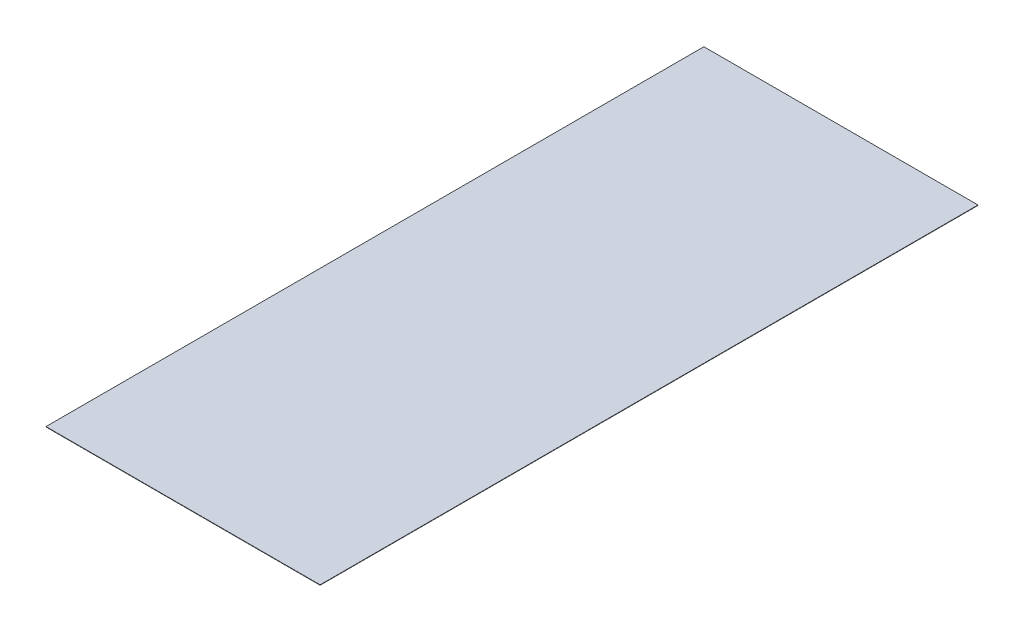
ISO-10303-21;
HEADER;
FILE_DESCRIPTION(('STEP AP214'),'2;1');
FILE_NAME('part.step','',(''),(''),'','','');
FILE_SCHEMA(('AUTOMOTIVE_DESIGN { 1 0 10303 214 1 1 1 1 }'));
ENDSEC;
DATA;
#1=APPLICATION_CONTEXT('core data for automotive mechanical design processes');
#2=APPLICATION_PROTOCOL_DEFINITION('international standard','automotive_design',2000,#1);
#3=PRODUCT_CONTEXT('',#1,'mechanical');
#4=PRODUCT('Part','Part','',(#3));
#5=PRODUCT_RELATED_PRODUCT_CATEGORY('part','',(#4));
#6=PRODUCT_DEFINITION_FORMATION('','',#4);
#7=PRODUCT_DEFINITION_CONTEXT('part definition',#1,'design');
#8=PRODUCT_DEFINITION('design','',#6,#7);
#9=PRODUCT_DEFINITION_SHAPE('','',#8);
#10=(LENGTH_UNIT() NAMED_UNIT(*) SI_UNIT(.MILLI.,.METRE.));
#11=(NAMED_UNIT(*) PLANE_ANGLE_UNIT() SI_UNIT($,.RADIAN.));
#12=(NAMED_UNIT(*) SI_UNIT($,.STERADIAN.) SOLID_ANGLE_UNIT());
#13=UNCERTAINTY_MEASURE_WITH_UNIT(LENGTH_MEASURE(1.E-05),#10,'distance_accuracy_value','');
#14=(GEOMETRIC_REPRESENTATION_CONTEXT(3) GLOBAL_UNCERTAINTY_ASSIGNED_CONTEXT((#13)) GLOBAL_UNIT_ASSIGNED_CONTEXT((#10,
#11,#12)) REPRESENTATION_CONTEXT('',''));
#15=CARTESIAN_POINT('',(0.,0.,0.));
#16=DIRECTION('',(0.,0.,1.));
#17=DIRECTION('',(1.,0.,0.));
#18=AXIS2_PLACEMENT_3D('',#15,#16,#17);
#19=CARTESIAN_POINT('',(0.,6.35,0.));
#20=DIRECTION('',(0.,1.,0.));
#21=DIRECTION('',(0.,0.,1.));
#22=AXIS2_PLACEMENT_3D('',#19,#20,#21);
#23=PLANE('',#22);
#24=DIRECTION('',(-1.,0.,0.));
#25=VECTOR('',#24,1.);
#26=CARTESIAN_POINT('',(2286.,6.35,-5486.4));
#27=LINE('',#26,#25);
#28=CARTESIAN_POINT('',(-2286.,6.35,-5486.4));
#29=VERTEX_POINT('',#28);
#30=CARTESIAN_POINT('',(2286.,6.35,-5486.4));
#31=VERTEX_POINT('',#30);
#32=EDGE_CURVE('E67',#29,#31,#27,.F.);
#33=ORIENTED_EDGE('',*,*,#32,.F.);
#34=DIRECTION('',(0.,0.,1.));
#35=VECTOR('',#34,1.);
#36=CARTESIAN_POINT('',(-2286.,6.35,-5486.4));
#37=LINE('',#36,#35);
#38=CARTESIAN_POINT('',(-2286.,6.35,5486.4));
#39=VERTEX_POINT('',#38);
#40=EDGE_CURVE('E19',#39,#29,#37,.F.);
#41=ORIENTED_EDGE('',*,*,#40,.F.);
#42=DIRECTION('',(1.,0.,0.));
#43=VECTOR('',#42,1.);
#44=CARTESIAN_POINT('',(-2286.,6.35,5486.4));
#45=LINE('',#44,#43);
#46=CARTESIAN_POINT('',(2286.,6.35,5486.4));
#47=VERTEX_POINT('',#46);
#48=EDGE_CURVE('E57',#47,#39,#45,.F.);
#49=ORIENTED_EDGE('',*,*,#48,.F.);
#50=DIRECTION('',(0.,0.,-1.));
#51=VECTOR('',#50,1.);
#52=CARTESIAN_POINT('',(2286.,6.35,5486.4));
#53=LINE('',#52,#51);
#54=EDGE_CURVE('E52',#31,#47,#53,.F.);
#55=ORIENTED_EDGE('',*,*,#54,.F.);
#56=EDGE_LOOP('',(#33,#41,#49,#55));
#57=FACE_BOUND('',#56,.T.);
#58=ADVANCED_FACE('F16',(#57),#23,.T.);
#59=CARTESIAN_POINT('',(-2286.,0.,-5486.4));
#60=DIRECTION('',(-1.,0.,0.));
#61=DIRECTION('',(0.,0.,1.));
#62=AXIS2_PLACEMENT_3D('',#59,#60,#61);
#63=PLANE('',#62);
#64=DIRECTION('',(0.,1.,0.));
#65=VECTOR('',#64,1.);
#66=CARTESIAN_POINT('',(-2286.,0.,-5486.4));
#67=LINE('',#66,#65);
#68=CARTESIAN_POINT('',(-2286.,0.,-5486.4));
#69=VERTEX_POINT('',#68);
#70=EDGE_CURVE('E78',#69,#29,#67,.T.);
#71=ORIENTED_EDGE('',*,*,#70,.F.);
#72=DIRECTION('',(0.,0.,1.));
#73=VECTOR('',#72,1.);
#74=CARTESIAN_POINT('',(-2286.,0.,0.));
#75=LINE('',#74,#73);
#76=CARTESIAN_POINT('',(-2286.,0.,5486.4));
#77=VERTEX_POINT('',#76);
#78=EDGE_CURVE('E73',#69,#77,#75,.T.);
#79=ORIENTED_EDGE('',*,*,#78,.T.);
#80=DIRECTION('',(0.,1.,0.));
#81=VECTOR('',#80,1.);
#82=CARTESIAN_POINT('',(-2286.,0.,5486.4));
#83=LINE('',#82,#81);
#84=EDGE_CURVE('E62',#39,#77,#83,.F.);
#85=ORIENTED_EDGE('',*,*,#84,.F.);
#86=ORIENTED_EDGE('',*,*,#40,.T.);
#87=EDGE_LOOP('',(#71,#79,#85,#86));
#88=FACE_BOUND('',#87,.T.);
#89=ADVANCED_FACE('F72',(#88),#63,.T.);
#90=CARTESIAN_POINT('',(-2286.,0.,5486.4));
#91=DIRECTION('',(0.,0.,1.));
#92=DIRECTION('',(1.,0.,0.));
#93=AXIS2_PLACEMENT_3D('',#90,#91,#92);
#94=PLANE('',#93);
#95=ORIENTED_EDGE('',*,*,#84,.T.);
#96=DIRECTION('',(1.,0.,0.));
#97=VECTOR('',#96,1.);
#98=CARTESIAN_POINT('',(0.,0.,5486.4));
#99=LINE('',#98,#97);
#100=CARTESIAN_POINT('',(2286.,0.,5486.4));
#101=VERTEX_POINT('',#100);
#102=EDGE_CURVE('E83',#77,#101,#99,.T.);
#103=ORIENTED_EDGE('',*,*,#102,.T.);
#104=DIRECTION('',(0.,1.,0.));
#105=VECTOR('',#104,1.);
#106=CARTESIAN_POINT('',(2286.,0.,5486.4));
#107=LINE('',#106,#105);
#108=EDGE_CURVE('E64',#47,#101,#107,.F.);
#109=ORIENTED_EDGE('',*,*,#108,.F.);
#110=ORIENTED_EDGE('',*,*,#48,.T.);
#111=EDGE_LOOP('',(#95,#103,#109,#110));
#112=FACE_BOUND('',#111,.T.);
#113=ADVANCED_FACE('F59',(#112),#94,.T.);
#114=CARTESIAN_POINT('',(2286.,0.,5486.4));
#115=DIRECTION('',(1.,0.,0.));
#116=DIRECTION('',(0.,0.,-1.));
#117=AXIS2_PLACEMENT_3D('',#114,#115,#116);
#118=PLANE('',#117);
#119=ORIENTED_EDGE('',*,*,#108,.T.);
#120=DIRECTION('',(0.,0.,1.));
#121=VECTOR('',#120,1.);
#122=CARTESIAN_POINT('',(2286.,0.,0.));
#123=LINE('',#122,#121);
#124=CARTESIAN_POINT('',(2286.,0.,-5486.4));
#125=VERTEX_POINT('',#124);
#126=EDGE_CURVE('E25',#101,#125,#123,.F.);
#127=ORIENTED_EDGE('',*,*,#126,.T.);
#128=DIRECTION('',(0.,1.,0.));
#129=VECTOR('',#128,1.);
#130=CARTESIAN_POINT('',(2286.,0.,-5486.4));
#131=LINE('',#130,#129);
#132=EDGE_CURVE('E33',#31,#125,#131,.F.);
#133=ORIENTED_EDGE('',*,*,#132,.F.);
#134=ORIENTED_EDGE('',*,*,#54,.T.);
#135=EDGE_LOOP('',(#119,#127,#133,#134));
#136=FACE_BOUND('',#135,.T.);
#137=ADVANCED_FACE('F87',(#136),#118,.T.);
#138=CARTESIAN_POINT('',(2286.,0.,-5486.4));
#139=DIRECTION('',(0.,0.,-1.));
#140=DIRECTION('',(-1.,0.,0.));
#141=AXIS2_PLACEMENT_3D('',#138,#139,#140);
#142=PLANE('',#141);
#143=ORIENTED_EDGE('',*,*,#132,.T.);
#144=DIRECTION('',(1.,0.,0.));
#145=VECTOR('',#144,1.);
#146=CARTESIAN_POINT('',(0.,0.,-5486.4));
#147=LINE('',#146,#145);
#148=EDGE_CURVE('E11',#125,#69,#147,.F.);
#149=ORIENTED_EDGE('',*,*,#148,.T.);
#150=ORIENTED_EDGE('',*,*,#70,.T.);
#151=ORIENTED_EDGE('',*,*,#32,.T.);
#152=EDGE_LOOP('',(#143,#149,#150,#151));
#153=FACE_BOUND('',#152,.T.);
#154=ADVANCED_FACE('F90',(#153),#142,.T.);
#155=CARTESIAN_POINT('',(0.,0.,0.));
#156=DIRECTION('',(0.,1.,0.));
#157=DIRECTION('',(0.,0.,1.));
#158=AXIS2_PLACEMENT_3D('',#155,#156,#157);
#159=PLANE('',#158);
#160=ORIENTED_EDGE('',*,*,#126,.F.);
#161=ORIENTED_EDGE('',*,*,#102,.F.);
#162=ORIENTED_EDGE('',*,*,#78,.F.);
#163=ORIENTED_EDGE('',*,*,#148,.F.);
#164=EDGE_LOOP('',(#160,#161,#162,#163));
#165=FACE_BOUND('',#164,.T.);
#166=ADVANCED_FACE('F89',(#165),#159,.F.);
#167=CLOSED_SHELL('',(#58,#89,#113,#137,#154,#166));
#168=MANIFOLD_SOLID_BREP('B1',#167);
#169=ADVANCED_BREP_SHAPE_REPRESENTATION('',(#18,#168),#14);
#170=SHAPE_DEFINITION_REPRESENTATION(#9,#169);
ENDSEC;
END-ISO-10303-21;
